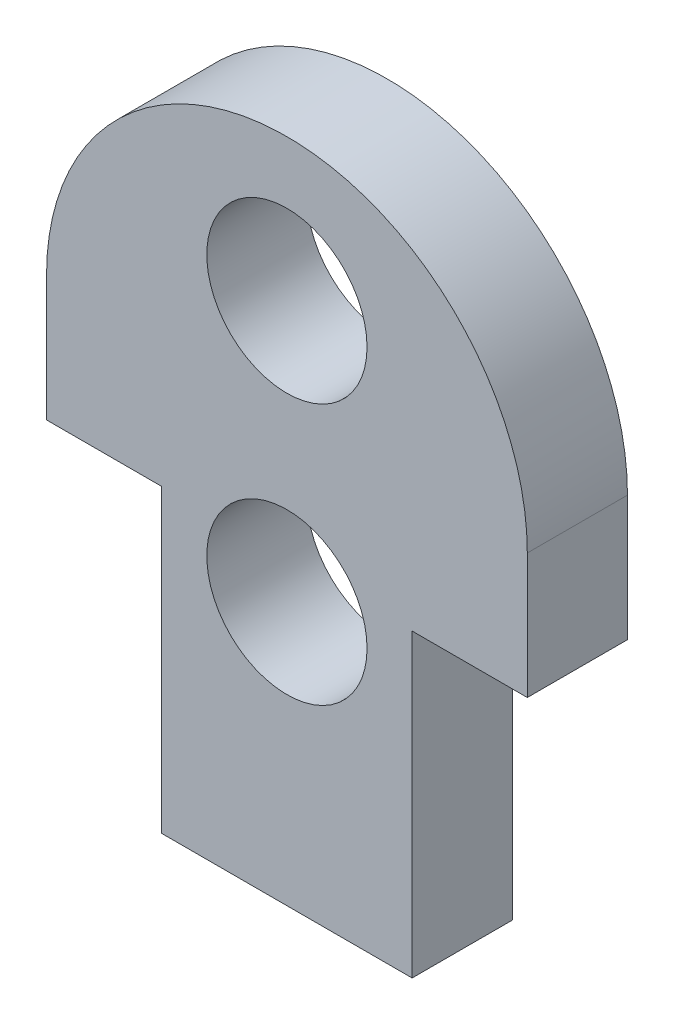
ISO-10303-21;
HEADER;
FILE_DESCRIPTION(('STEP AP214'),'2;1');
FILE_NAME('part.step','',(''),(''),'','','');
FILE_SCHEMA(('AUTOMOTIVE_DESIGN { 1 0 10303 214 1 1 1 1 }'));
ENDSEC;
DATA;
#1=APPLICATION_CONTEXT('core data for automotive mechanical design processes');
#2=APPLICATION_PROTOCOL_DEFINITION('international standard','automotive_design',2000,#1);
#3=PRODUCT_CONTEXT('',#1,'mechanical');
#4=PRODUCT('Part','Part','',(#3));
#5=PRODUCT_RELATED_PRODUCT_CATEGORY('part','',(#4));
#6=PRODUCT_DEFINITION_FORMATION('','',#4);
#7=PRODUCT_DEFINITION_CONTEXT('part definition',#1,'design');
#8=PRODUCT_DEFINITION('design','',#6,#7);
#9=PRODUCT_DEFINITION_SHAPE('','',#8);
#10=(LENGTH_UNIT() NAMED_UNIT(*) SI_UNIT(.MILLI.,.METRE.));
#11=(NAMED_UNIT(*) PLANE_ANGLE_UNIT() SI_UNIT($,.RADIAN.));
#12=(NAMED_UNIT(*) SI_UNIT($,.STERADIAN.) SOLID_ANGLE_UNIT());
#13=UNCERTAINTY_MEASURE_WITH_UNIT(LENGTH_MEASURE(1.E-05),#10,'distance_accuracy_value','');
#14=(GEOMETRIC_REPRESENTATION_CONTEXT(3) GLOBAL_UNCERTAINTY_ASSIGNED_CONTEXT((#13)) GLOBAL_UNIT_ASSIGNED_CONTEXT((#10,
#11,#12)) REPRESENTATION_CONTEXT('',''));
#15=CARTESIAN_POINT('',(0.,0.,0.));
#16=DIRECTION('',(0.,0.,1.));
#17=DIRECTION('',(1.,0.,0.));
#18=AXIS2_PLACEMENT_3D('',#15,#16,#17);
#19=CARTESIAN_POINT('',(5.,17.,4.));
#20=DIRECTION('',(0.,0.,1.));
#21=DIRECTION('',(1.,0.,0.));
#22=AXIS2_PLACEMENT_3D('',#19,#20,#21);
#23=PLANE('',#22);
#24=CARTESIAN_POINT('',(5.,20.9211723588727,4.));
#25=DIRECTION('',(0.,0.,1.));
#26=DIRECTION('',(1.,0.,0.));
#27=AXIS2_PLACEMENT_3D('',#24,#25,#26);
#28=CIRCLE('',#27,3.2);
#29=CARTESIAN_POINT('',(8.2,20.9211723588727,4.));
#30=VERTEX_POINT('',#29);
#31=EDGE_CURVE('E137',#30,#30,#28,.T.);
#32=ORIENTED_EDGE('',*,*,#31,.F.);
#33=EDGE_LOOP('',(#32));
#34=FACE_BOUND('',#33,.T.);
#35=DIRECTION('',(0.,1.,0.));
#36=VECTOR('',#35,1.);
#37=CARTESIAN_POINT('',(10.,0.,4.));
#38=LINE('',#37,#36);
#39=CARTESIAN_POINT('',(10.,0.,4.));
#40=VERTEX_POINT('',#39);
#41=CARTESIAN_POINT('',(10.,12.,4.));
#42=VERTEX_POINT('',#41);
#43=EDGE_CURVE('E161',#40,#42,#38,.T.);
#44=ORIENTED_EDGE('',*,*,#43,.T.);
#45=DIRECTION('',(1.,0.,0.));
#46=VECTOR('',#45,1.);
#47=CARTESIAN_POINT('',(10.,12.,4.));
#48=LINE('',#47,#46);
#49=CARTESIAN_POINT('',(14.6,12.,4.));
#50=VERTEX_POINT('',#49);
#51=EDGE_CURVE('E175',#42,#50,#48,.T.);
#52=ORIENTED_EDGE('',*,*,#51,.T.);
#53=DIRECTION('',(0.,1.,0.));
#54=VECTOR('',#53,1.);
#55=CARTESIAN_POINT('',(14.6,12.,4.));
#56=LINE('',#55,#54);
#57=CARTESIAN_POINT('',(14.6,17.,4.));
#58=VERTEX_POINT('',#57);
#59=EDGE_CURVE('E113',#50,#58,#56,.T.);
#60=ORIENTED_EDGE('',*,*,#59,.T.);
#61=CARTESIAN_POINT('',(5.,17.,4.));
#62=DIRECTION('',(0.,0.,1.));
#63=DIRECTION('',(1.,0.,0.));
#64=AXIS2_PLACEMENT_3D('',#61,#62,#63);
#65=CIRCLE('',#64,9.6);
#66=CARTESIAN_POINT('',(-4.6,17.,4.));
#67=VERTEX_POINT('',#66);
#68=EDGE_CURVE('E107',#58,#67,#65,.T.);
#69=ORIENTED_EDGE('',*,*,#68,.T.);
#70=DIRECTION('',(0.,-1.,0.));
#71=VECTOR('',#70,1.);
#72=CARTESIAN_POINT('',(-4.6,12.,4.));
#73=LINE('',#72,#71);
#74=CARTESIAN_POINT('',(-4.6,12.,4.));
#75=VERTEX_POINT('',#74);
#76=EDGE_CURVE('E111',#67,#75,#73,.T.);
#77=ORIENTED_EDGE('',*,*,#76,.T.);
#78=DIRECTION('',(1.,0.,0.));
#79=VECTOR('',#78,1.);
#80=CARTESIAN_POINT('',(0.,12.,4.));
#81=LINE('',#80,#79);
#82=CARTESIAN_POINT('',(0.,12.,4.));
#83=VERTEX_POINT('',#82);
#84=EDGE_CURVE('E127',#75,#83,#81,.T.);
#85=ORIENTED_EDGE('',*,*,#84,.T.);
#86=DIRECTION('',(0.,-1.,0.));
#87=VECTOR('',#86,1.);
#88=CARTESIAN_POINT('',(0.,0.,4.));
#89=LINE('',#88,#87);
#90=CARTESIAN_POINT('',(0.,0.,4.));
#91=VERTEX_POINT('',#90);
#92=EDGE_CURVE('E49',#83,#91,#89,.T.);
#93=ORIENTED_EDGE('',*,*,#92,.T.);
#94=DIRECTION('',(1.,0.,0.));
#95=VECTOR('',#94,1.);
#96=CARTESIAN_POINT('',(0.,0.,4.));
#97=LINE('',#96,#95);
#98=EDGE_CURVE('E93',#91,#40,#97,.T.);
#99=ORIENTED_EDGE('',*,*,#98,.T.);
#100=EDGE_LOOP('',(#44,#52,#60,#69,#77,#85,#93,#99));
#101=FACE_BOUND('',#100,.T.);
#102=CARTESIAN_POINT('',(5.,10.5,4.));
#103=DIRECTION('',(0.,0.,1.));
#104=DIRECTION('',(1.,0.,0.));
#105=AXIS2_PLACEMENT_3D('',#102,#103,#104);
#106=CIRCLE('',#105,3.2);
#107=CARTESIAN_POINT('',(8.2,10.5,4.));
#108=VERTEX_POINT('',#107);
#109=EDGE_CURVE('E184',#108,#108,#106,.T.);
#110=ORIENTED_EDGE('',*,*,#109,.F.);
#111=EDGE_LOOP('',(#110));
#112=FACE_BOUND('',#111,.T.);
#113=ADVANCED_FACE('F32',(#34,#101,#112),#23,.T.);
#114=CARTESIAN_POINT('',(5.,17.,0.));
#115=DIRECTION('',(0.,0.,1.));
#116=DIRECTION('',(1.,0.,0.));
#117=AXIS2_PLACEMENT_3D('',#114,#115,#116);
#118=PLANE('',#117);
#119=CARTESIAN_POINT('',(5.,20.9211723588727,0.));
#120=DIRECTION('',(0.,0.,1.));
#121=DIRECTION('',(1.,0.,0.));
#122=AXIS2_PLACEMENT_3D('',#119,#120,#121);
#123=CIRCLE('',#122,3.2);
#124=CARTESIAN_POINT('',(8.2,20.9211723588727,0.));
#125=VERTEX_POINT('',#124);
#126=EDGE_CURVE('E181',#125,#125,#123,.T.);
#127=ORIENTED_EDGE('',*,*,#126,.T.);
#128=EDGE_LOOP('',(#127));
#129=FACE_BOUND('',#128,.T.);
#130=DIRECTION('',(0.,1.,0.));
#131=VECTOR('',#130,1.);
#132=CARTESIAN_POINT('',(10.,8.,0.));
#133=LINE('',#132,#131);
#134=CARTESIAN_POINT('',(10.,0.,0.));
#135=VERTEX_POINT('',#134);
#136=CARTESIAN_POINT('',(10.,12.,0.));
#137=VERTEX_POINT('',#136);
#138=EDGE_CURVE('E136',#135,#137,#133,.T.);
#139=ORIENTED_EDGE('',*,*,#138,.F.);
#140=DIRECTION('',(1.,0.,0.));
#141=VECTOR('',#140,1.);
#142=CARTESIAN_POINT('',(0.,0.,0.));
#143=LINE('',#142,#141);
#144=CARTESIAN_POINT('',(0.,0.,0.));
#145=VERTEX_POINT('',#144);
#146=EDGE_CURVE('E133',#145,#135,#143,.T.);
#147=ORIENTED_EDGE('',*,*,#146,.F.);
#148=DIRECTION('',(0.,-1.,0.));
#149=VECTOR('',#148,1.);
#150=CARTESIAN_POINT('',(0.,8.,0.));
#151=LINE('',#150,#149);
#152=CARTESIAN_POINT('',(0.,12.,0.));
#153=VERTEX_POINT('',#152);
#154=EDGE_CURVE('E146',#153,#145,#151,.T.);
#155=ORIENTED_EDGE('',*,*,#154,.F.);
#156=DIRECTION('',(1.,0.,0.));
#157=VECTOR('',#156,1.);
#158=CARTESIAN_POINT('',(0.,12.,0.));
#159=LINE('',#158,#157);
#160=CARTESIAN_POINT('',(-4.6,12.,0.));
#161=VERTEX_POINT('',#160);
#162=EDGE_CURVE('E86',#161,#153,#159,.T.);
#163=ORIENTED_EDGE('',*,*,#162,.F.);
#164=DIRECTION('',(0.,-1.,0.));
#165=VECTOR('',#164,1.);
#166=CARTESIAN_POINT('',(-4.6,12.,0.));
#167=LINE('',#166,#165);
#168=CARTESIAN_POINT('',(-4.6,17.,0.));
#169=VERTEX_POINT('',#168);
#170=EDGE_CURVE('E79',#169,#161,#167,.T.);
#171=ORIENTED_EDGE('',*,*,#170,.F.);
#172=CARTESIAN_POINT('',(5.,17.,0.));
#173=DIRECTION('',(0.,0.,1.));
#174=DIRECTION('',(1.,0.,0.));
#175=AXIS2_PLACEMENT_3D('',#172,#173,#174);
#176=CIRCLE('',#175,9.6);
#177=CARTESIAN_POINT('',(14.6,17.,0.));
#178=VERTEX_POINT('',#177);
#179=EDGE_CURVE('E121',#178,#169,#176,.T.);
#180=ORIENTED_EDGE('',*,*,#179,.F.);
#181=DIRECTION('',(0.,1.,0.));
#182=VECTOR('',#181,1.);
#183=CARTESIAN_POINT('',(14.6,12.,0.));
#184=LINE('',#183,#182);
#185=CARTESIAN_POINT('',(14.6,12.,0.));
#186=VERTEX_POINT('',#185);
#187=EDGE_CURVE('E141',#186,#178,#184,.T.);
#188=ORIENTED_EDGE('',*,*,#187,.F.);
#189=DIRECTION('',(1.,0.,0.));
#190=VECTOR('',#189,1.);
#191=CARTESIAN_POINT('',(10.,12.,0.));
#192=LINE('',#191,#190);
#193=EDGE_CURVE('E139',#137,#186,#192,.T.);
#194=ORIENTED_EDGE('',*,*,#193,.F.);
#195=EDGE_LOOP('',(#139,#147,#155,#163,#171,#180,#188,#194));
#196=FACE_BOUND('',#195,.T.);
#197=CARTESIAN_POINT('',(5.,10.5,0.));
#198=DIRECTION('',(0.,0.,1.));
#199=DIRECTION('',(1.,0.,0.));
#200=AXIS2_PLACEMENT_3D('',#197,#198,#199);
#201=CIRCLE('',#200,3.2);
#202=CARTESIAN_POINT('',(8.2,10.5,0.));
#203=VERTEX_POINT('',#202);
#204=EDGE_CURVE('E187',#203,#203,#201,.T.);
#205=ORIENTED_EDGE('',*,*,#204,.T.);
#206=EDGE_LOOP('',(#205));
#207=FACE_BOUND('',#206,.T.);
#208=ADVANCED_FACE('F165',(#129,#196,#207),#118,.F.);
#209=CARTESIAN_POINT('',(0.,0.,4.));
#210=DIRECTION('',(0.,1.,0.));
#211=DIRECTION('',(0.,0.,1.));
#212=AXIS2_PLACEMENT_3D('',#209,#210,#211);
#213=PLANE('',#212);
#214=ORIENTED_EDGE('',*,*,#146,.T.);
#215=DIRECTION('',(0.,0.,-1.));
#216=VECTOR('',#215,1.);
#217=CARTESIAN_POINT('',(10.,0.,4.));
#218=LINE('',#217,#216);
#219=EDGE_CURVE('E41',#40,#135,#218,.T.);
#220=ORIENTED_EDGE('',*,*,#219,.F.);
#221=ORIENTED_EDGE('',*,*,#98,.F.);
#222=DIRECTION('',(0.,0.,-1.));
#223=VECTOR('',#222,1.);
#224=CARTESIAN_POINT('',(0.,0.,4.));
#225=LINE('',#224,#223);
#226=EDGE_CURVE('E11',#91,#145,#225,.T.);
#227=ORIENTED_EDGE('',*,*,#226,.T.);
#228=EDGE_LOOP('',(#214,#220,#221,#227));
#229=FACE_BOUND('',#228,.T.);
#230=ADVANCED_FACE('F34',(#229),#213,.F.);
#231=CARTESIAN_POINT('',(10.,8.,4.));
#232=DIRECTION('',(-1.,0.,0.));
#233=DIRECTION('',(0.,0.,1.));
#234=AXIS2_PLACEMENT_3D('',#231,#232,#233);
#235=PLANE('',#234);
#236=ORIENTED_EDGE('',*,*,#138,.T.);
#237=DIRECTION('',(0.,0.,-1.));
#238=VECTOR('',#237,1.);
#239=CARTESIAN_POINT('',(10.,12.,4.));
#240=LINE('',#239,#238);
#241=EDGE_CURVE('E154',#42,#137,#240,.T.);
#242=ORIENTED_EDGE('',*,*,#241,.F.);
#243=ORIENTED_EDGE('',*,*,#43,.F.);
#244=ORIENTED_EDGE('',*,*,#219,.T.);
#245=EDGE_LOOP('',(#236,#242,#243,#244));
#246=FACE_BOUND('',#245,.T.);
#247=ADVANCED_FACE('F159',(#246),#235,.F.);
#248=CARTESIAN_POINT('',(10.,12.,4.));
#249=DIRECTION('',(0.,1.,0.));
#250=DIRECTION('',(0.,0.,1.));
#251=AXIS2_PLACEMENT_3D('',#248,#249,#250);
#252=PLANE('',#251);
#253=ORIENTED_EDGE('',*,*,#193,.T.);
#254=DIRECTION('',(0.,0.,-1.));
#255=VECTOR('',#254,1.);
#256=CARTESIAN_POINT('',(14.6,12.,4.));
#257=LINE('',#256,#255);
#258=EDGE_CURVE('E151',#50,#186,#257,.T.);
#259=ORIENTED_EDGE('',*,*,#258,.F.);
#260=ORIENTED_EDGE('',*,*,#51,.F.);
#261=ORIENTED_EDGE('',*,*,#241,.T.);
#262=EDGE_LOOP('',(#253,#259,#260,#261));
#263=FACE_BOUND('',#262,.T.);
#264=ADVANCED_FACE('F171',(#263),#252,.F.);
#265=CARTESIAN_POINT('',(14.6,12.,4.));
#266=DIRECTION('',(-1.,0.,0.));
#267=DIRECTION('',(0.,0.,1.));
#268=AXIS2_PLACEMENT_3D('',#265,#266,#267);
#269=PLANE('',#268);
#270=ORIENTED_EDGE('',*,*,#187,.T.);
#271=DIRECTION('',(0.,0.,-1.));
#272=VECTOR('',#271,1.);
#273=CARTESIAN_POINT('',(14.6,17.,4.));
#274=LINE('',#273,#272);
#275=EDGE_CURVE('E122',#58,#178,#274,.T.);
#276=ORIENTED_EDGE('',*,*,#275,.F.);
#277=ORIENTED_EDGE('',*,*,#59,.F.);
#278=ORIENTED_EDGE('',*,*,#258,.T.);
#279=EDGE_LOOP('',(#270,#276,#277,#278));
#280=FACE_BOUND('',#279,.T.);
#281=ADVANCED_FACE('F174',(#280),#269,.F.);
#282=CARTESIAN_POINT('',(5.,17.,4.));
#283=DIRECTION('',(0.,0.,-1.));
#284=DIRECTION('',(-1.,0.,0.));
#285=AXIS2_PLACEMENT_3D('',#282,#283,#284);
#286=CYLINDRICAL_SURFACE('',#285,9.6);
#287=ORIENTED_EDGE('',*,*,#179,.T.);
#288=DIRECTION('',(0.,0.,-1.));
#289=VECTOR('',#288,1.);
#290=CARTESIAN_POINT('',(-4.6,17.,4.));
#291=LINE('',#290,#289);
#292=EDGE_CURVE('E118',#67,#169,#291,.T.);
#293=ORIENTED_EDGE('',*,*,#292,.F.);
#294=ORIENTED_EDGE('',*,*,#68,.F.);
#295=ORIENTED_EDGE('',*,*,#275,.T.);
#296=EDGE_LOOP('',(#287,#293,#294,#295));
#297=FACE_BOUND('',#296,.T.);
#298=ADVANCED_FACE('F119',(#297),#286,.T.);
#299=CARTESIAN_POINT('',(-4.6,12.,4.));
#300=DIRECTION('',(1.,0.,0.));
#301=DIRECTION('',(0.,0.,-1.));
#302=AXIS2_PLACEMENT_3D('',#299,#300,#301);
#303=PLANE('',#302);
#304=ORIENTED_EDGE('',*,*,#170,.T.);
#305=DIRECTION('',(0.,0.,-1.));
#306=VECTOR('',#305,1.);
#307=CARTESIAN_POINT('',(-4.6,12.,4.));
#308=LINE('',#307,#306);
#309=EDGE_CURVE('E123',#75,#161,#308,.T.);
#310=ORIENTED_EDGE('',*,*,#309,.F.);
#311=ORIENTED_EDGE('',*,*,#76,.F.);
#312=ORIENTED_EDGE('',*,*,#292,.T.);
#313=EDGE_LOOP('',(#304,#310,#311,#312));
#314=FACE_BOUND('',#313,.T.);
#315=ADVANCED_FACE('F125',(#314),#303,.F.);
#316=CARTESIAN_POINT('',(0.,12.,4.));
#317=DIRECTION('',(0.,1.,0.));
#318=DIRECTION('',(0.,0.,1.));
#319=AXIS2_PLACEMENT_3D('',#316,#317,#318);
#320=PLANE('',#319);
#321=ORIENTED_EDGE('',*,*,#162,.T.);
#322=DIRECTION('',(0.,0.,-1.));
#323=VECTOR('',#322,1.);
#324=CARTESIAN_POINT('',(0.,12.,4.));
#325=LINE('',#324,#323);
#326=EDGE_CURVE('E129',#83,#153,#325,.T.);
#327=ORIENTED_EDGE('',*,*,#326,.F.);
#328=ORIENTED_EDGE('',*,*,#84,.F.);
#329=ORIENTED_EDGE('',*,*,#309,.T.);
#330=EDGE_LOOP('',(#321,#327,#328,#329));
#331=FACE_BOUND('',#330,.T.);
#332=ADVANCED_FACE('F211',(#331),#320,.F.);
#333=CARTESIAN_POINT('',(0.,8.,4.));
#334=DIRECTION('',(1.,0.,0.));
#335=DIRECTION('',(0.,0.,-1.));
#336=AXIS2_PLACEMENT_3D('',#333,#334,#335);
#337=PLANE('',#336);
#338=ORIENTED_EDGE('',*,*,#154,.T.);
#339=ORIENTED_EDGE('',*,*,#226,.F.);
#340=ORIENTED_EDGE('',*,*,#92,.F.);
#341=ORIENTED_EDGE('',*,*,#326,.T.);
#342=EDGE_LOOP('',(#338,#339,#340,#341));
#343=FACE_BOUND('',#342,.T.);
#344=ADVANCED_FACE('F208',(#343),#337,.F.);
#345=CARTESIAN_POINT('',(5.,20.9211723588727,4.));
#346=DIRECTION('',(0.,0.,-1.));
#347=DIRECTION('',(-1.,0.,0.));
#348=AXIS2_PLACEMENT_3D('',#345,#346,#347);
#349=CYLINDRICAL_SURFACE('',#348,3.2);
#350=ORIENTED_EDGE('',*,*,#31,.T.);
#351=EDGE_LOOP('',(#350));
#352=FACE_BOUND('',#351,.T.);
#353=ORIENTED_EDGE('',*,*,#126,.F.);
#354=EDGE_LOOP('',(#353));
#355=FACE_BOUND('',#354,.T.);
#356=ADVANCED_FACE('F205',(#352,#355),#349,.F.);
#357=CARTESIAN_POINT('',(5.,10.5,4.));
#358=DIRECTION('',(0.,0.,-1.));
#359=DIRECTION('',(-1.,0.,0.));
#360=AXIS2_PLACEMENT_3D('',#357,#358,#359);
#361=CYLINDRICAL_SURFACE('',#360,3.2);
#362=ORIENTED_EDGE('',*,*,#109,.T.);
#363=EDGE_LOOP('',(#362));
#364=FACE_BOUND('',#363,.T.);
#365=ORIENTED_EDGE('',*,*,#204,.F.);
#366=EDGE_LOOP('',(#365));
#367=FACE_BOUND('',#366,.T.);
#368=ADVANCED_FACE('F193',(#364,#367),#361,.F.);
#369=CLOSED_SHELL('',(#113,#208,#230,#247,#264,#281,#298,#315,#332,#344,#356,#368));
#370=MANIFOLD_SOLID_BREP('B2',#369);
#371=ADVANCED_BREP_SHAPE_REPRESENTATION('',(#18,#370),#14);
#372=SHAPE_DEFINITION_REPRESENTATION(#9,#371);
ENDSEC;
END-ISO-10303-21;
